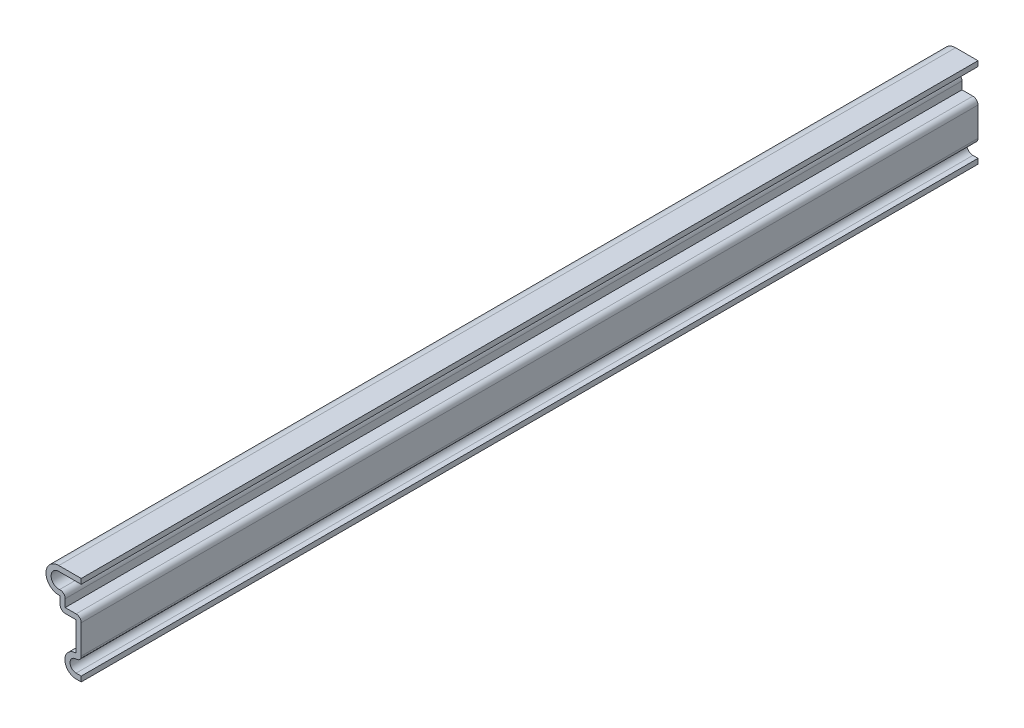
ISO-10303-21;
HEADER;
FILE_DESCRIPTION(('STEP AP214'),'2;1');
FILE_NAME('part.step','',(''),(''),'','','');
FILE_SCHEMA(('AUTOMOTIVE_DESIGN { 1 0 10303 214 1 1 1 1 }'));
ENDSEC;
DATA;
#1=APPLICATION_CONTEXT('core data for automotive mechanical design processes');
#2=APPLICATION_PROTOCOL_DEFINITION('international standard','automotive_design',2000,#1);
#3=PRODUCT_CONTEXT('',#1,'mechanical');
#4=PRODUCT('Part','Part','',(#3));
#5=PRODUCT_RELATED_PRODUCT_CATEGORY('part','',(#4));
#6=PRODUCT_DEFINITION_FORMATION('','',#4);
#7=PRODUCT_DEFINITION_CONTEXT('part definition',#1,'design');
#8=PRODUCT_DEFINITION('design','',#6,#7);
#9=PRODUCT_DEFINITION_SHAPE('','',#8);
#10=(LENGTH_UNIT() NAMED_UNIT(*) SI_UNIT(.MILLI.,.METRE.));
#11=(NAMED_UNIT(*) PLANE_ANGLE_UNIT() SI_UNIT($,.RADIAN.));
#12=(NAMED_UNIT(*) SI_UNIT($,.STERADIAN.) SOLID_ANGLE_UNIT());
#13=UNCERTAINTY_MEASURE_WITH_UNIT(LENGTH_MEASURE(1.E-05),#10,'distance_accuracy_value','');
#14=(GEOMETRIC_REPRESENTATION_CONTEXT(3) GLOBAL_UNCERTAINTY_ASSIGNED_CONTEXT((#13)) GLOBAL_UNIT_ASSIGNED_CONTEXT((#10,
#11,#12)) REPRESENTATION_CONTEXT('',''));
#15=CARTESIAN_POINT('',(0.,0.,0.));
#16=DIRECTION('',(0.,0.,1.));
#17=DIRECTION('',(1.,0.,0.));
#18=AXIS2_PLACEMENT_3D('',#15,#16,#17);
#19=CARTESIAN_POINT('',(-1.27,0.,-222.25));
#20=DIRECTION('',(0.,-1.,0.));
#21=DIRECTION('',(1.,0.,0.));
#22=AXIS2_PLACEMENT_3D('',#19,#20,#21);
#23=PLANE('',#22);
#24=DIRECTION('',(1.,0.,0.));
#25=VECTOR('',#24,1.);
#26=CARTESIAN_POINT('',(-1.27,0.,0.));
#27=LINE('',#26,#25);
#28=CARTESIAN_POINT('',(-1.27,0.,0.));
#29=VERTEX_POINT('',#28);
#30=CARTESIAN_POINT('',(0.,0.,0.));
#31=VERTEX_POINT('',#30);
#32=EDGE_CURVE('E236',#29,#31,#27,.T.);
#33=ORIENTED_EDGE('',*,*,#32,.F.);
#34=DIRECTION('',(0.,0.,1.));
#35=VECTOR('',#34,1.);
#36=CARTESIAN_POINT('',(-1.27,0.,-222.25));
#37=LINE('',#36,#35);
#38=CARTESIAN_POINT('',(-1.27,0.,-222.25));
#39=VERTEX_POINT('',#38);
#40=EDGE_CURVE('E197',#39,#29,#37,.T.);
#41=ORIENTED_EDGE('',*,*,#40,.F.);
#42=DIRECTION('',(1.,0.,0.));
#43=VECTOR('',#42,1.);
#44=CARTESIAN_POINT('',(-1.27,0.,-222.25));
#45=LINE('',#44,#43);
#46=CARTESIAN_POINT('',(0.,0.,-222.25));
#47=VERTEX_POINT('',#46);
#48=EDGE_CURVE('E178',#39,#47,#45,.T.);
#49=ORIENTED_EDGE('',*,*,#48,.T.);
#50=DIRECTION('',(0.,0.,1.));
#51=VECTOR('',#50,1.);
#52=CARTESIAN_POINT('',(0.,0.,-222.25));
#53=LINE('',#52,#51);
#54=EDGE_CURVE('E187',#47,#31,#53,.T.);
#55=ORIENTED_EDGE('',*,*,#54,.T.);
#56=EDGE_LOOP('',(#33,#41,#49,#55));
#57=FACE_BOUND('',#56,.T.);
#58=ADVANCED_FACE('F35',(#57),#23,.T.);
#59=CARTESIAN_POINT('',(-1.27,2.778125,-222.25));
#60=DIRECTION('',(0.,0.,1.));
#61=DIRECTION('',(1.,0.,0.));
#62=AXIS2_PLACEMENT_3D('',#59,#60,#61);
#63=CYLINDRICAL_SURFACE('',#62,2.778125);
#64=CARTESIAN_POINT('',(-1.27,2.778125,0.));
#65=DIRECTION('',(0.,0.,1.));
#66=DIRECTION('',(1.,0.,0.));
#67=AXIS2_PLACEMENT_3D('',#64,#65,#66);
#68=CIRCLE('',#67,2.778125);
#69=CARTESIAN_POINT('',(-1.27,5.55625,0.));
#70=VERTEX_POINT('',#69);
#71=EDGE_CURVE('E198',#70,#29,#68,.T.);
#72=ORIENTED_EDGE('',*,*,#71,.F.);
#73=DIRECTION('',(0.,0.,1.));
#74=VECTOR('',#73,1.);
#75=CARTESIAN_POINT('',(-1.27,5.55625,-222.25));
#76=LINE('',#75,#74);
#77=CARTESIAN_POINT('',(-1.27,5.55625,-222.25));
#78=VERTEX_POINT('',#77);
#79=EDGE_CURVE('E272',#78,#70,#76,.T.);
#80=ORIENTED_EDGE('',*,*,#79,.F.);
#81=CARTESIAN_POINT('',(-1.27,2.778125,-222.25));
#82=DIRECTION('',(0.,0.,1.));
#83=DIRECTION('',(1.,0.,0.));
#84=AXIS2_PLACEMENT_3D('',#81,#82,#83);
#85=CIRCLE('',#84,2.778125);
#86=EDGE_CURVE('E195',#78,#39,#85,.T.);
#87=ORIENTED_EDGE('',*,*,#86,.T.);
#88=ORIENTED_EDGE('',*,*,#40,.T.);
#89=EDGE_LOOP('',(#72,#80,#87,#88));
#90=FACE_BOUND('',#89,.T.);
#91=ADVANCED_FACE('F359',(#90),#63,.T.);
#92=CARTESIAN_POINT('',(-1.27,12.7159148871865,-222.25));
#93=DIRECTION('',(-1.,0.,0.));
#94=DIRECTION('',(0.,-1.,0.));
#95=AXIS2_PLACEMENT_3D('',#92,#93,#94);
#96=PLANE('',#95);
#97=DIRECTION('',(0.,-1.,0.));
#98=VECTOR('',#97,1.);
#99=CARTESIAN_POINT('',(-1.27,12.7159148871865,0.));
#100=LINE('',#99,#98);
#101=CARTESIAN_POINT('',(-1.27,12.7159148871865,0.));
#102=VERTEX_POINT('',#101);
#103=EDGE_CURVE('E201',#102,#70,#100,.T.);
#104=ORIENTED_EDGE('',*,*,#103,.F.);
#105=DIRECTION('',(0.,0.,1.));
#106=VECTOR('',#105,1.);
#107=CARTESIAN_POINT('',(-1.27,12.7159148871865,-222.25));
#108=LINE('',#107,#106);
#109=CARTESIAN_POINT('',(-1.27,12.7159148871865,-222.25));
#110=VERTEX_POINT('',#109);
#111=EDGE_CURVE('E274',#110,#102,#108,.T.);
#112=ORIENTED_EDGE('',*,*,#111,.F.);
#113=DIRECTION('',(0.,-1.,0.));
#114=VECTOR('',#113,1.);
#115=CARTESIAN_POINT('',(-1.27,12.7159148871865,-222.25));
#116=LINE('',#115,#114);
#117=EDGE_CURVE('E232',#110,#78,#116,.T.);
#118=ORIENTED_EDGE('',*,*,#117,.T.);
#119=ORIENTED_EDGE('',*,*,#79,.T.);
#120=EDGE_LOOP('',(#104,#112,#118,#119));
#121=FACE_BOUND('',#120,.T.);
#122=ADVANCED_FACE('F364',(#121),#96,.T.);
#123=CARTESIAN_POINT('',(-5.23875,12.7159148871865,-222.25));
#124=DIRECTION('',(0.,-1.,0.));
#125=DIRECTION('',(0.,0.,-1.));
#126=AXIS2_PLACEMENT_3D('',#123,#124,#125);
#127=PLANE('',#126);
#128=DIRECTION('',(1.,0.,0.));
#129=VECTOR('',#128,1.);
#130=CARTESIAN_POINT('',(-5.23875,12.7159148871865,0.));
#131=LINE('',#130,#129);
#132=CARTESIAN_POINT('',(-3.96875,12.7159148871865,0.));
#133=VERTEX_POINT('',#132);
#134=EDGE_CURVE('E266',#133,#102,#131,.T.);
#135=ORIENTED_EDGE('',*,*,#134,.F.);
#136=DIRECTION('',(0.,0.,1.));
#137=VECTOR('',#136,1.);
#138=CARTESIAN_POINT('',(-3.96875,12.7159148871865,-222.25));
#139=LINE('',#138,#137);
#140=CARTESIAN_POINT('',(-3.96875,12.7159148871865,-222.25));
#141=VERTEX_POINT('',#140);
#142=EDGE_CURVE('E306',#133,#141,#139,.F.);
#143=ORIENTED_EDGE('',*,*,#142,.T.);
#144=DIRECTION('',(1.,0.,0.));
#145=VECTOR('',#144,1.);
#146=CARTESIAN_POINT('',(-5.23875,12.7159148871865,-222.25));
#147=LINE('',#146,#145);
#148=EDGE_CURVE('E230',#141,#110,#147,.T.);
#149=ORIENTED_EDGE('',*,*,#148,.T.);
#150=ORIENTED_EDGE('',*,*,#111,.T.);
#151=EDGE_LOOP('',(#135,#143,#149,#150));
#152=FACE_BOUND('',#151,.T.);
#153=ADVANCED_FACE('F367',(#152),#127,.T.);
#154=CARTESIAN_POINT('',(-5.23875,15.8909148871865,-222.25));
#155=DIRECTION('',(-1.,0.,0.));
#156=DIRECTION('',(0.,0.,1.));
#157=AXIS2_PLACEMENT_3D('',#154,#155,#156);
#158=PLANE('',#157);
#159=DIRECTION('',(0.,-1.,0.));
#160=VECTOR('',#159,1.);
#161=CARTESIAN_POINT('',(-5.23875,15.8909148871865,-222.25));
#162=LINE('',#161,#160);
#163=CARTESIAN_POINT('',(-5.23875,15.8909148871865,-222.25));
#164=VERTEX_POINT('',#163);
#165=CARTESIAN_POINT('',(-5.23875,13.9859148871865,-222.25));
#166=VERTEX_POINT('',#165);
#167=EDGE_CURVE('E227',#164,#166,#162,.T.);
#168=ORIENTED_EDGE('',*,*,#167,.T.);
#169=DIRECTION('',(0.,0.,1.));
#170=VECTOR('',#169,1.);
#171=CARTESIAN_POINT('',(-5.23875,13.9859148871865,-222.25));
#172=LINE('',#171,#170);
#173=CARTESIAN_POINT('',(-5.23875,13.9859148871865,0.));
#174=VERTEX_POINT('',#173);
#175=EDGE_CURVE('E271',#166,#174,#172,.T.);
#176=ORIENTED_EDGE('',*,*,#175,.T.);
#177=DIRECTION('',(0.,-1.,0.));
#178=VECTOR('',#177,1.);
#179=CARTESIAN_POINT('',(-5.23875,15.8909148871865,0.));
#180=LINE('',#179,#178);
#181=CARTESIAN_POINT('',(-5.23875,15.8909148871865,0.));
#182=VERTEX_POINT('',#181);
#183=EDGE_CURVE('E263',#182,#174,#180,.T.);
#184=ORIENTED_EDGE('',*,*,#183,.F.);
#185=DIRECTION('',(0.,0.,1.));
#186=VECTOR('',#185,1.);
#187=CARTESIAN_POINT('',(-5.23875,15.8909148871865,-222.25));
#188=LINE('',#187,#186);
#189=EDGE_CURVE('E277',#164,#182,#188,.T.);
#190=ORIENTED_EDGE('',*,*,#189,.F.);
#191=EDGE_LOOP('',(#168,#176,#184,#190));
#192=FACE_BOUND('',#191,.T.);
#193=ADVANCED_FACE('F375',(#192),#158,.T.);
#194=CARTESIAN_POINT('',(-5.55625,19.05,-222.25));
#195=DIRECTION('',(0.,0.,1.));
#196=DIRECTION('',(1.,0.,0.));
#197=AXIS2_PLACEMENT_3D('',#194,#195,#196);
#198=CYLINDRICAL_SURFACE('',#197,3.175);
#199=CARTESIAN_POINT('',(-5.55625,19.05,0.));
#200=DIRECTION('',(0.,0.,1.));
#201=DIRECTION('',(1.,0.,0.));
#202=AXIS2_PLACEMENT_3D('',#199,#200,#201);
#203=CIRCLE('',#202,3.175);
#204=CARTESIAN_POINT('',(-5.55625,22.225,0.));
#205=VERTEX_POINT('',#204);
#206=EDGE_CURVE('E260',#205,#182,#203,.T.);
#207=ORIENTED_EDGE('',*,*,#206,.F.);
#208=DIRECTION('',(0.,0.,1.));
#209=VECTOR('',#208,1.);
#210=CARTESIAN_POINT('',(-5.55625,22.225,-222.25));
#211=LINE('',#210,#209);
#212=CARTESIAN_POINT('',(-5.55625,22.225,-222.25));
#213=VERTEX_POINT('',#212);
#214=EDGE_CURVE('E279',#213,#205,#211,.T.);
#215=ORIENTED_EDGE('',*,*,#214,.F.);
#216=CARTESIAN_POINT('',(-5.55625,19.05,-222.25));
#217=DIRECTION('',(0.,0.,1.));
#218=DIRECTION('',(1.,0.,0.));
#219=AXIS2_PLACEMENT_3D('',#216,#217,#218);
#220=CIRCLE('',#219,3.175);
#221=EDGE_CURVE('E224',#213,#164,#220,.T.);
#222=ORIENTED_EDGE('',*,*,#221,.T.);
#223=ORIENTED_EDGE('',*,*,#189,.T.);
#224=EDGE_LOOP('',(#207,#215,#222,#223));
#225=FACE_BOUND('',#224,.T.);
#226=ADVANCED_FACE('F379',(#225),#198,.T.);
#227=CARTESIAN_POINT('',(0.,22.225,-222.25));
#228=DIRECTION('',(0.,1.,0.));
#229=DIRECTION('',(0.,0.,1.));
#230=AXIS2_PLACEMENT_3D('',#227,#228,#229);
#231=PLANE('',#230);
#232=DIRECTION('',(-1.,0.,0.));
#233=VECTOR('',#232,1.);
#234=CARTESIAN_POINT('',(0.,22.225,0.));
#235=LINE('',#234,#233);
#236=CARTESIAN_POINT('',(0.,22.225,0.));
#237=VERTEX_POINT('',#236);
#238=EDGE_CURVE('E257',#237,#205,#235,.T.);
#239=ORIENTED_EDGE('',*,*,#238,.F.);
#240=DIRECTION('',(0.,0.,1.));
#241=VECTOR('',#240,1.);
#242=CARTESIAN_POINT('',(0.,22.225,-222.25));
#243=LINE('',#242,#241);
#244=CARTESIAN_POINT('',(0.,22.225,-222.25));
#245=VERTEX_POINT('',#244);
#246=EDGE_CURVE('E281',#245,#237,#243,.T.);
#247=ORIENTED_EDGE('',*,*,#246,.F.);
#248=DIRECTION('',(-1.,0.,0.));
#249=VECTOR('',#248,1.);
#250=CARTESIAN_POINT('',(0.,22.225,-222.25));
#251=LINE('',#250,#249);
#252=EDGE_CURVE('E221',#245,#213,#251,.T.);
#253=ORIENTED_EDGE('',*,*,#252,.T.);
#254=ORIENTED_EDGE('',*,*,#214,.T.);
#255=EDGE_LOOP('',(#239,#247,#253,#254));
#256=FACE_BOUND('',#255,.T.);
#257=ADVANCED_FACE('F383',(#256),#231,.T.);
#258=CARTESIAN_POINT('',(0.,22.225,-222.25));
#259=DIRECTION('',(-1.,0.,0.));
#260=DIRECTION('',(0.,0.,1.));
#261=AXIS2_PLACEMENT_3D('',#258,#259,#260);
#262=PLANE('',#261);
#263=DIRECTION('',(0.,-1.,0.));
#264=VECTOR('',#263,1.);
#265=CARTESIAN_POINT('',(0.,22.225,0.));
#266=LINE('',#265,#264);
#267=CARTESIAN_POINT('',(0.,20.955,0.));
#268=VERTEX_POINT('',#267);
#269=EDGE_CURVE('E255',#237,#268,#266,.T.);
#270=ORIENTED_EDGE('',*,*,#269,.T.);
#271=DIRECTION('',(0.,0.,1.));
#272=VECTOR('',#271,1.);
#273=CARTESIAN_POINT('',(0.,20.955,-222.25));
#274=LINE('',#273,#272);
#275=CARTESIAN_POINT('',(0.,20.955,-222.25));
#276=VERTEX_POINT('',#275);
#277=EDGE_CURVE('E283',#276,#268,#274,.T.);
#278=ORIENTED_EDGE('',*,*,#277,.F.);
#279=DIRECTION('',(0.,-1.,0.));
#280=VECTOR('',#279,1.);
#281=CARTESIAN_POINT('',(0.,22.225,-222.25));
#282=LINE('',#281,#280);
#283=EDGE_CURVE('E219',#245,#276,#282,.T.);
#284=ORIENTED_EDGE('',*,*,#283,.F.);
#285=ORIENTED_EDGE('',*,*,#246,.T.);
#286=EDGE_LOOP('',(#270,#278,#284,#285));
#287=FACE_BOUND('',#286,.T.);
#288=ADVANCED_FACE('F388',(#287),#262,.F.);
#289=CARTESIAN_POINT('',(0.,20.955,-222.25));
#290=DIRECTION('',(0.,1.,0.));
#291=DIRECTION('',(0.,0.,1.));
#292=AXIS2_PLACEMENT_3D('',#289,#290,#291);
#293=PLANE('',#292);
#294=DIRECTION('',(1.,0.,0.));
#295=VECTOR('',#294,1.);
#296=CARTESIAN_POINT('',(0.,20.955,0.));
#297=LINE('',#296,#295);
#298=CARTESIAN_POINT('',(-5.55625,20.955,0.));
#299=VERTEX_POINT('',#298);
#300=EDGE_CURVE('E253',#268,#299,#297,.F.);
#301=ORIENTED_EDGE('',*,*,#300,.T.);
#302=DIRECTION('',(0.,0.,1.));
#303=VECTOR('',#302,1.);
#304=CARTESIAN_POINT('',(-5.55625,20.955,-222.25));
#305=LINE('',#304,#303);
#306=CARTESIAN_POINT('',(-5.55625,20.955,-222.25));
#307=VERTEX_POINT('',#306);
#308=EDGE_CURVE('E286',#307,#299,#305,.T.);
#309=ORIENTED_EDGE('',*,*,#308,.F.);
#310=DIRECTION('',(1.,0.,0.));
#311=VECTOR('',#310,1.);
#312=CARTESIAN_POINT('',(0.,20.955,-222.25));
#313=LINE('',#312,#311);
#314=EDGE_CURVE('E217',#276,#307,#313,.F.);
#315=ORIENTED_EDGE('',*,*,#314,.F.);
#316=ORIENTED_EDGE('',*,*,#277,.T.);
#317=EDGE_LOOP('',(#301,#309,#315,#316));
#318=FACE_BOUND('',#317,.T.);
#319=ADVANCED_FACE('F393',(#318),#293,.F.);
#320=CARTESIAN_POINT('',(-5.55625,19.05,-222.25));
#321=DIRECTION('',(0.,0.,1.));
#322=DIRECTION('',(1.,0.,0.));
#323=AXIS2_PLACEMENT_3D('',#320,#321,#322);
#324=CYLINDRICAL_SURFACE('',#323,1.905);
#325=CARTESIAN_POINT('',(-5.55625,19.05,0.));
#326=DIRECTION('',(0.,0.,1.));
#327=DIRECTION('',(1.,0.,0.));
#328=AXIS2_PLACEMENT_3D('',#325,#326,#327);
#329=CIRCLE('',#328,1.905);
#330=CARTESIAN_POINT('',(-5.36575,17.1545489323119,0.));
#331=VERTEX_POINT('',#330);
#332=EDGE_CURVE('E250',#299,#331,#329,.T.);
#333=ORIENTED_EDGE('',*,*,#332,.T.);
#334=DIRECTION('',(0.,0.,1.));
#335=VECTOR('',#334,1.);
#336=CARTESIAN_POINT('',(-5.36575,17.1545489323119,-222.25));
#337=LINE('',#336,#335);
#338=CARTESIAN_POINT('',(-5.36575,17.1545489323119,-222.25));
#339=VERTEX_POINT('',#338);
#340=EDGE_CURVE('E11',#331,#339,#337,.F.);
#341=ORIENTED_EDGE('',*,*,#340,.T.);
#342=CARTESIAN_POINT('',(-5.55625,19.05,-222.25));
#343=DIRECTION('',(0.,0.,1.));
#344=DIRECTION('',(1.,0.,0.));
#345=AXIS2_PLACEMENT_3D('',#342,#343,#344);
#346=CIRCLE('',#345,1.905);
#347=EDGE_CURVE('E214',#307,#339,#346,.T.);
#348=ORIENTED_EDGE('',*,*,#347,.F.);
#349=ORIENTED_EDGE('',*,*,#308,.T.);
#350=EDGE_LOOP('',(#333,#341,#348,#349));
#351=FACE_BOUND('',#350,.T.);
#352=ADVANCED_FACE('F396',(#351),#324,.F.);
#353=CARTESIAN_POINT('',(-3.96875,15.8909148871865,-222.25));
#354=DIRECTION('',(-1.,0.,0.));
#355=DIRECTION('',(0.,0.,1.));
#356=AXIS2_PLACEMENT_3D('',#353,#354,#355);
#357=PLANE('',#356);
#358=DIRECTION('',(0.,1.,0.));
#359=VECTOR('',#358,1.);
#360=CARTESIAN_POINT('',(-3.96875,15.8909148871865,-222.25));
#361=LINE('',#360,#359);
#362=CARTESIAN_POINT('',(-3.96875,15.8909148871865,-222.25));
#363=VERTEX_POINT('',#362);
#364=CARTESIAN_POINT('',(-3.96875,13.9859148871865,-222.25));
#365=VERTEX_POINT('',#364);
#366=EDGE_CURVE('E212',#363,#365,#361,.F.);
#367=ORIENTED_EDGE('',*,*,#366,.F.);
#368=DIRECTION('',(0.,0.,1.));
#369=VECTOR('',#368,1.);
#370=CARTESIAN_POINT('',(-3.96875,15.8909148871865,-222.25));
#371=LINE('',#370,#369);
#372=CARTESIAN_POINT('',(-3.96875,15.8909148871865,0.));
#373=VERTEX_POINT('',#372);
#374=EDGE_CURVE('E43',#363,#373,#371,.T.);
#375=ORIENTED_EDGE('',*,*,#374,.T.);
#376=DIRECTION('',(0.,1.,0.));
#377=VECTOR('',#376,1.);
#378=CARTESIAN_POINT('',(-3.96875,15.8909148871865,0.));
#379=LINE('',#378,#377);
#380=CARTESIAN_POINT('',(-3.96875,13.9859148871865,0.));
#381=VERTEX_POINT('',#380);
#382=EDGE_CURVE('E248',#373,#381,#379,.F.);
#383=ORIENTED_EDGE('',*,*,#382,.T.);
#384=DIRECTION('',(0.,0.,1.));
#385=VECTOR('',#384,1.);
#386=CARTESIAN_POINT('',(-3.96875,13.9859148871865,-222.25));
#387=LINE('',#386,#385);
#388=EDGE_CURVE('E289',#365,#381,#387,.T.);
#389=ORIENTED_EDGE('',*,*,#388,.F.);
#390=EDGE_LOOP('',(#367,#375,#383,#389));
#391=FACE_BOUND('',#390,.T.);
#392=ADVANCED_FACE('F328',(#391),#357,.F.);
#393=CARTESIAN_POINT('',(-5.23875,13.9859148871865,-222.25));
#394=DIRECTION('',(0.,-1.,0.));
#395=DIRECTION('',(0.,0.,-1.));
#396=AXIS2_PLACEMENT_3D('',#393,#394,#395);
#397=PLANE('',#396);
#398=DIRECTION('',(1.,0.,0.));
#399=VECTOR('',#398,1.);
#400=CARTESIAN_POINT('',(-5.23875,13.9859148871865,0.));
#401=LINE('',#400,#399);
#402=CARTESIAN_POINT('',(-1.27,13.9859148871865,0.));
#403=VERTEX_POINT('',#402);
#404=EDGE_CURVE('E245',#381,#403,#401,.T.);
#405=ORIENTED_EDGE('',*,*,#404,.T.);
#406=DIRECTION('',(0.,0.,1.));
#407=VECTOR('',#406,1.);
#408=CARTESIAN_POINT('',(-1.27,13.9859148871865,-222.25));
#409=LINE('',#408,#407);
#410=CARTESIAN_POINT('',(-1.27,13.9859148871865,-222.25));
#411=VERTEX_POINT('',#410);
#412=EDGE_CURVE('E322',#403,#411,#409,.F.);
#413=ORIENTED_EDGE('',*,*,#412,.T.);
#414=DIRECTION('',(1.,0.,0.));
#415=VECTOR('',#414,1.);
#416=CARTESIAN_POINT('',(-5.23875,13.9859148871865,-222.25));
#417=LINE('',#416,#415);
#418=EDGE_CURVE('E209',#365,#411,#417,.T.);
#419=ORIENTED_EDGE('',*,*,#418,.F.);
#420=ORIENTED_EDGE('',*,*,#388,.T.);
#421=EDGE_LOOP('',(#405,#413,#419,#420));
#422=FACE_BOUND('',#421,.T.);
#423=ADVANCED_FACE('F339',(#422),#397,.F.);
#424=CARTESIAN_POINT('',(0.,12.7159148871865,-222.25));
#425=DIRECTION('',(-1.,0.,0.));
#426=DIRECTION('',(0.,-1.,0.));
#427=AXIS2_PLACEMENT_3D('',#424,#425,#426);
#428=PLANE('',#427);
#429=DIRECTION('',(0.,-1.,0.));
#430=VECTOR('',#429,1.);
#431=CARTESIAN_POINT('',(0.,12.7159148871865,0.));
#432=LINE('',#431,#430);
#433=CARTESIAN_POINT('',(0.,12.7159148871865,0.));
#434=VERTEX_POINT('',#433);
#435=CARTESIAN_POINT('',(0.,5.55625,0.));
#436=VERTEX_POINT('',#435);
#437=EDGE_CURVE('E243',#434,#436,#432,.T.);
#438=ORIENTED_EDGE('',*,*,#437,.T.);
#439=DIRECTION('',(0.,0.,1.));
#440=VECTOR('',#439,1.);
#441=CARTESIAN_POINT('',(0.,5.55625,-222.25));
#442=LINE('',#441,#440);
#443=CARTESIAN_POINT('',(0.,5.55625,-222.25));
#444=VERTEX_POINT('',#443);
#445=EDGE_CURVE('E58',#436,#444,#442,.F.);
#446=ORIENTED_EDGE('',*,*,#445,.T.);
#447=DIRECTION('',(0.,-1.,0.));
#448=VECTOR('',#447,1.);
#449=CARTESIAN_POINT('',(0.,12.7159148871865,-222.25));
#450=LINE('',#449,#448);
#451=CARTESIAN_POINT('',(0.,12.7159148871865,-222.25));
#452=VERTEX_POINT('',#451);
#453=EDGE_CURVE('E207',#452,#444,#450,.T.);
#454=ORIENTED_EDGE('',*,*,#453,.F.);
#455=DIRECTION('',(0.,0.,1.));
#456=VECTOR('',#455,1.);
#457=CARTESIAN_POINT('',(0.,12.7159148871865,-222.25));
#458=LINE('',#457,#456);
#459=EDGE_CURVE('E318',#452,#434,#458,.T.);
#460=ORIENTED_EDGE('',*,*,#459,.T.);
#461=EDGE_LOOP('',(#438,#446,#454,#460));
#462=FACE_BOUND('',#461,.T.);
#463=ADVANCED_FACE('F345',(#462),#428,.F.);
#464=CARTESIAN_POINT('',(-1.27,2.778125,-222.25));
#465=DIRECTION('',(0.,0.,1.));
#466=DIRECTION('',(1.,0.,0.));
#467=AXIS2_PLACEMENT_3D('',#464,#465,#466);
#468=CYLINDRICAL_SURFACE('',#467,1.508125);
#469=CARTESIAN_POINT('',(-1.27,2.778125,-222.25));
#470=DIRECTION('',(0.,0.,1.));
#471=DIRECTION('',(1.,0.,0.));
#472=AXIS2_PLACEMENT_3D('',#469,#470,#471);
#473=CIRCLE('',#472,1.508125);
#474=CARTESIAN_POINT('',(-1.27,4.28625,-222.25));
#475=VERTEX_POINT('',#474);
#476=CARTESIAN_POINT('',(-1.27,1.27,-222.25));
#477=VERTEX_POINT('',#476);
#478=EDGE_CURVE('E205',#475,#477,#473,.T.);
#479=ORIENTED_EDGE('',*,*,#478,.F.);
#480=DIRECTION('',(0.,0.,1.));
#481=VECTOR('',#480,1.);
#482=CARTESIAN_POINT('',(-1.27,4.28625,-222.25));
#483=LINE('',#482,#481);
#484=CARTESIAN_POINT('',(-1.27,4.28625,0.));
#485=VERTEX_POINT('',#484);
#486=EDGE_CURVE('E315',#475,#485,#483,.T.);
#487=ORIENTED_EDGE('',*,*,#486,.T.);
#488=CARTESIAN_POINT('',(-1.27,2.778125,0.));
#489=DIRECTION('',(0.,0.,1.));
#490=DIRECTION('',(1.,0.,0.));
#491=AXIS2_PLACEMENT_3D('',#488,#489,#490);
#492=CIRCLE('',#491,1.508125);
#493=CARTESIAN_POINT('',(-1.27,1.27,0.));
#494=VERTEX_POINT('',#493);
#495=EDGE_CURVE('E241',#485,#494,#492,.T.);
#496=ORIENTED_EDGE('',*,*,#495,.T.);
#497=DIRECTION('',(0.,0.,1.));
#498=VECTOR('',#497,1.);
#499=CARTESIAN_POINT('',(-1.27,1.27,-222.25));
#500=LINE('',#499,#498);
#501=EDGE_CURVE('E292',#477,#494,#500,.T.);
#502=ORIENTED_EDGE('',*,*,#501,.F.);
#503=EDGE_LOOP('',(#479,#487,#496,#502));
#504=FACE_BOUND('',#503,.T.);
#505=ADVANCED_FACE('F352',(#504),#468,.F.);
#506=CARTESIAN_POINT('',(-1.27,1.27,-222.25));
#507=DIRECTION('',(0.,-1.,0.));
#508=DIRECTION('',(1.,0.,0.));
#509=AXIS2_PLACEMENT_3D('',#506,#507,#508);
#510=PLANE('',#509);
#511=DIRECTION('',(1.,0.,0.));
#512=VECTOR('',#511,1.);
#513=CARTESIAN_POINT('',(-1.27,1.27,0.));
#514=LINE('',#513,#512);
#515=CARTESIAN_POINT('',(0.,1.27,0.));
#516=VERTEX_POINT('',#515);
#517=EDGE_CURVE('E239',#494,#516,#514,.T.);
#518=ORIENTED_EDGE('',*,*,#517,.T.);
#519=DIRECTION('',(0.,0.,1.));
#520=VECTOR('',#519,1.);
#521=CARTESIAN_POINT('',(0.,1.27,-222.25));
#522=LINE('',#521,#520);
#523=CARTESIAN_POINT('',(0.,1.27,-222.25));
#524=VERTEX_POINT('',#523);
#525=EDGE_CURVE('E194',#524,#516,#522,.T.);
#526=ORIENTED_EDGE('',*,*,#525,.F.);
#527=DIRECTION('',(1.,0.,0.));
#528=VECTOR('',#527,1.);
#529=CARTESIAN_POINT('',(-1.27,1.27,-222.25));
#530=LINE('',#529,#528);
#531=EDGE_CURVE('E181',#477,#524,#530,.T.);
#532=ORIENTED_EDGE('',*,*,#531,.F.);
#533=ORIENTED_EDGE('',*,*,#501,.T.);
#534=EDGE_LOOP('',(#518,#526,#532,#533));
#535=FACE_BOUND('',#534,.T.);
#536=ADVANCED_FACE('F355',(#535),#510,.F.);
#537=CARTESIAN_POINT('',(0.,1.27,-222.25));
#538=DIRECTION('',(-1.,0.,0.));
#539=DIRECTION('',(0.,0.,1.));
#540=AXIS2_PLACEMENT_3D('',#537,#538,#539);
#541=PLANE('',#540);
#542=DIRECTION('',(0.,-1.,0.));
#543=VECTOR('',#542,1.);
#544=CARTESIAN_POINT('',(0.,1.27,0.));
#545=LINE('',#544,#543);
#546=EDGE_CURVE('E190',#516,#31,#545,.T.);
#547=ORIENTED_EDGE('',*,*,#546,.T.);
#548=ORIENTED_EDGE('',*,*,#54,.F.);
#549=DIRECTION('',(0.,-1.,0.));
#550=VECTOR('',#549,1.);
#551=CARTESIAN_POINT('',(0.,1.27,-222.25));
#552=LINE('',#551,#550);
#553=EDGE_CURVE('E172',#524,#47,#552,.T.);
#554=ORIENTED_EDGE('',*,*,#553,.F.);
#555=ORIENTED_EDGE('',*,*,#525,.T.);
#556=EDGE_LOOP('',(#547,#548,#554,#555));
#557=FACE_BOUND('',#556,.T.);
#558=ADVANCED_FACE('F188',(#557),#541,.F.);
#559=CARTESIAN_POINT('',(-1.27,2.778125,-222.25));
#560=DIRECTION('',(0.,0.,1.));
#561=DIRECTION('',(1.,0.,0.));
#562=AXIS2_PLACEMENT_3D('',#559,#560,#561);
#563=PLANE('',#562);
#564=ORIENTED_EDGE('',*,*,#148,.F.);
#565=CARTESIAN_POINT('',(-3.96875,13.9859148871865,-222.25));
#566=DIRECTION('',(0.,0.,1.));
#567=DIRECTION('',(1.,0.,0.));
#568=AXIS2_PLACEMENT_3D('',#565,#566,#567);
#569=CIRCLE('',#568,1.27);
#570=EDGE_CURVE('E313',#141,#166,#569,.F.);
#571=ORIENTED_EDGE('',*,*,#570,.T.);
#572=ORIENTED_EDGE('',*,*,#167,.F.);
#573=ORIENTED_EDGE('',*,*,#221,.F.);
#574=ORIENTED_EDGE('',*,*,#252,.F.);
#575=ORIENTED_EDGE('',*,*,#283,.T.);
#576=ORIENTED_EDGE('',*,*,#314,.T.);
#577=ORIENTED_EDGE('',*,*,#347,.T.);
#578=CARTESIAN_POINT('',(-5.23875,15.8909148871865,-222.25));
#579=DIRECTION('',(0.,0.,1.));
#580=DIRECTION('',(1.,0.,0.));
#581=AXIS2_PLACEMENT_3D('',#578,#579,#580);
#582=CIRCLE('',#581,1.27);
#583=EDGE_CURVE('E308',#339,#363,#582,.F.);
#584=ORIENTED_EDGE('',*,*,#583,.T.);
#585=ORIENTED_EDGE('',*,*,#366,.T.);
#586=ORIENTED_EDGE('',*,*,#418,.T.);
#587=CARTESIAN_POINT('',(-1.27,12.7159148871865,-222.25));
#588=DIRECTION('',(0.,0.,1.));
#589=DIRECTION('',(1.,0.,0.));
#590=AXIS2_PLACEMENT_3D('',#587,#588,#589);
#591=CIRCLE('',#590,1.27);
#592=EDGE_CURVE('E310',#411,#452,#591,.F.);
#593=ORIENTED_EDGE('',*,*,#592,.T.);
#594=ORIENTED_EDGE('',*,*,#453,.T.);
#595=CARTESIAN_POINT('',(-1.27,5.55625,-222.25));
#596=DIRECTION('',(0.,0.,1.));
#597=DIRECTION('',(1.,0.,0.));
#598=AXIS2_PLACEMENT_3D('',#595,#596,#597);
#599=CIRCLE('',#598,1.27);
#600=EDGE_CURVE('E50',#444,#475,#599,.F.);
#601=ORIENTED_EDGE('',*,*,#600,.T.);
#602=ORIENTED_EDGE('',*,*,#478,.T.);
#603=ORIENTED_EDGE('',*,*,#531,.T.);
#604=ORIENTED_EDGE('',*,*,#553,.T.);
#605=ORIENTED_EDGE('',*,*,#48,.F.);
#606=ORIENTED_EDGE('',*,*,#86,.F.);
#607=ORIENTED_EDGE('',*,*,#117,.F.);
#608=EDGE_LOOP('',(#564,#571,#572,#573,#574,#575,#576,#577,#584,#585,#586,#593,#594,#601,#602,
#603,#604,#605,#606,#607));
#609=FACE_BOUND('',#608,.T.);
#610=ADVANCED_FACE('F175',(#609),#563,.F.);
#611=CARTESIAN_POINT('',(-1.27,2.778125,0.));
#612=DIRECTION('',(0.,0.,1.));
#613=DIRECTION('',(1.,0.,0.));
#614=AXIS2_PLACEMENT_3D('',#611,#612,#613);
#615=PLANE('',#614);
#616=ORIENTED_EDGE('',*,*,#183,.T.);
#617=CARTESIAN_POINT('',(-3.96875,13.9859148871865,0.));
#618=DIRECTION('',(0.,0.,1.));
#619=DIRECTION('',(1.,0.,0.));
#620=AXIS2_PLACEMENT_3D('',#617,#618,#619);
#621=CIRCLE('',#620,1.27);
#622=EDGE_CURVE('E304',#174,#133,#621,.T.);
#623=ORIENTED_EDGE('',*,*,#622,.T.);
#624=ORIENTED_EDGE('',*,*,#134,.T.);
#625=ORIENTED_EDGE('',*,*,#103,.T.);
#626=ORIENTED_EDGE('',*,*,#71,.T.);
#627=ORIENTED_EDGE('',*,*,#32,.T.);
#628=ORIENTED_EDGE('',*,*,#546,.F.);
#629=ORIENTED_EDGE('',*,*,#517,.F.);
#630=ORIENTED_EDGE('',*,*,#495,.F.);
#631=CARTESIAN_POINT('',(-1.27,5.55625,0.));
#632=DIRECTION('',(0.,0.,1.));
#633=DIRECTION('',(1.,0.,0.));
#634=AXIS2_PLACEMENT_3D('',#631,#632,#633);
#635=CIRCLE('',#634,1.27);
#636=EDGE_CURVE('E302',#485,#436,#635,.T.);
#637=ORIENTED_EDGE('',*,*,#636,.T.);
#638=ORIENTED_EDGE('',*,*,#437,.F.);
#639=CARTESIAN_POINT('',(-1.27,12.7159148871865,0.));
#640=DIRECTION('',(0.,0.,1.));
#641=DIRECTION('',(1.,0.,0.));
#642=AXIS2_PLACEMENT_3D('',#639,#640,#641);
#643=CIRCLE('',#642,1.27);
#644=EDGE_CURVE('E300',#434,#403,#643,.T.);
#645=ORIENTED_EDGE('',*,*,#644,.T.);
#646=ORIENTED_EDGE('',*,*,#404,.F.);
#647=ORIENTED_EDGE('',*,*,#382,.F.);
#648=CARTESIAN_POINT('',(-5.23875,15.8909148871865,0.));
#649=DIRECTION('',(0.,0.,1.));
#650=DIRECTION('',(1.,0.,0.));
#651=AXIS2_PLACEMENT_3D('',#648,#649,#650);
#652=CIRCLE('',#651,1.27);
#653=EDGE_CURVE('E298',#373,#331,#652,.T.);
#654=ORIENTED_EDGE('',*,*,#653,.T.);
#655=ORIENTED_EDGE('',*,*,#332,.F.);
#656=ORIENTED_EDGE('',*,*,#300,.F.);
#657=ORIENTED_EDGE('',*,*,#269,.F.);
#658=ORIENTED_EDGE('',*,*,#238,.T.);
#659=ORIENTED_EDGE('',*,*,#206,.T.);
#660=EDGE_LOOP('',(#616,#623,#624,#625,#626,#627,#628,#629,#630,#637,#638,#645,#646,#647,#654,
#655,#656,#657,#658,#659));
#661=FACE_BOUND('',#660,.T.);
#662=ADVANCED_FACE('F334',(#661),#615,.T.);
#663=CARTESIAN_POINT('',(-3.96875,13.9859148871865,-222.25));
#664=DIRECTION('',(0.,0.,1.));
#665=DIRECTION('',(1.,0.,0.));
#666=AXIS2_PLACEMENT_3D('',#663,#664,#665);
#667=CYLINDRICAL_SURFACE('',#666,1.27);
#668=ORIENTED_EDGE('',*,*,#570,.F.);
#669=ORIENTED_EDGE('',*,*,#142,.F.);
#670=ORIENTED_EDGE('',*,*,#622,.F.);
#671=ORIENTED_EDGE('',*,*,#175,.F.);
#672=EDGE_LOOP('',(#668,#669,#670,#671));
#673=FACE_BOUND('',#672,.T.);
#674=ADVANCED_FACE('F370',(#673),#667,.T.);
#675=CARTESIAN_POINT('',(-1.27,5.55625,-222.25));
#676=DIRECTION('',(0.,0.,1.));
#677=DIRECTION('',(1.,0.,0.));
#678=AXIS2_PLACEMENT_3D('',#675,#676,#677);
#679=CYLINDRICAL_SURFACE('',#678,1.27);
#680=ORIENTED_EDGE('',*,*,#600,.F.);
#681=ORIENTED_EDGE('',*,*,#445,.F.);
#682=ORIENTED_EDGE('',*,*,#636,.F.);
#683=ORIENTED_EDGE('',*,*,#486,.F.);
#684=EDGE_LOOP('',(#680,#681,#682,#683));
#685=FACE_BOUND('',#684,.T.);
#686=ADVANCED_FACE('F350',(#685),#679,.T.);
#687=CARTESIAN_POINT('',(-1.27,12.7159148871865,-222.25));
#688=DIRECTION('',(0.,0.,1.));
#689=DIRECTION('',(1.,0.,0.));
#690=AXIS2_PLACEMENT_3D('',#687,#688,#689);
#691=CYLINDRICAL_SURFACE('',#690,1.27);
#692=ORIENTED_EDGE('',*,*,#592,.F.);
#693=ORIENTED_EDGE('',*,*,#412,.F.);
#694=ORIENTED_EDGE('',*,*,#644,.F.);
#695=ORIENTED_EDGE('',*,*,#459,.F.);
#696=EDGE_LOOP('',(#692,#693,#694,#695));
#697=FACE_BOUND('',#696,.T.);
#698=ADVANCED_FACE('F343',(#697),#691,.T.);
#699=CARTESIAN_POINT('',(-5.23875,15.8909148871865,-222.25));
#700=DIRECTION('',(0.,0.,1.));
#701=DIRECTION('',(1.,0.,0.));
#702=AXIS2_PLACEMENT_3D('',#699,#700,#701);
#703=CYLINDRICAL_SURFACE('',#702,1.27);
#704=ORIENTED_EDGE('',*,*,#583,.F.);
#705=ORIENTED_EDGE('',*,*,#340,.F.);
#706=ORIENTED_EDGE('',*,*,#653,.F.);
#707=ORIENTED_EDGE('',*,*,#374,.F.);
#708=EDGE_LOOP('',(#704,#705,#706,#707));
#709=FACE_BOUND('',#708,.T.);
#710=ADVANCED_FACE('F37',(#709),#703,.T.);
#711=CLOSED_SHELL('',(#58,#91,#122,#153,#193,#226,#257,#288,#319,#352,#392,#423,#463,#505,#536,
#558,#610,#662,#674,#686,#698,#710));
#712=MANIFOLD_SOLID_BREP('B2',#711);
#713=ADVANCED_BREP_SHAPE_REPRESENTATION('',(#18,#712),#14);
#714=SHAPE_DEFINITION_REPRESENTATION(#9,#713);
ENDSEC;
END-ISO-10303-21;
